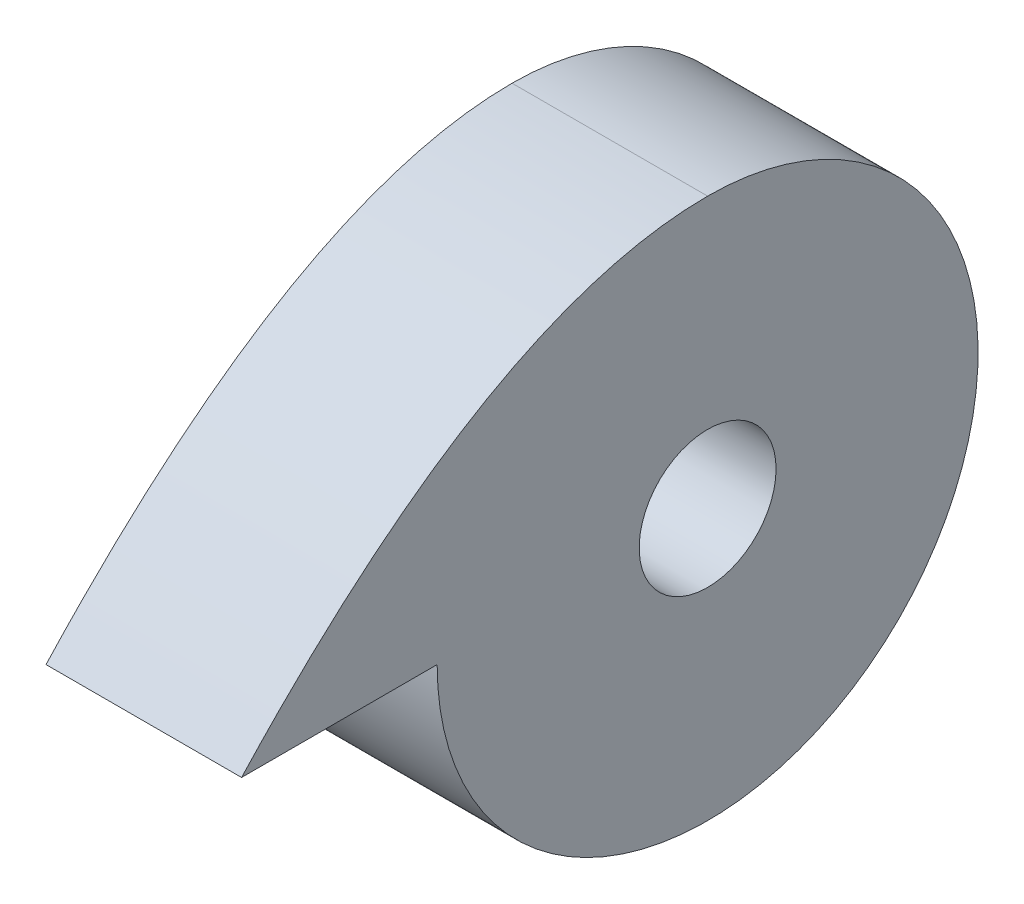
ISO-10303-21;
HEADER;
FILE_DESCRIPTION(('STEP AP214'),'2;1');
FILE_NAME('part.step','',(''),(''),'','','');
FILE_SCHEMA(('AUTOMOTIVE_DESIGN { 1 0 10303 214 1 1 1 1 }'));
ENDSEC;
DATA;
#1=APPLICATION_CONTEXT('core data for automotive mechanical design processes');
#2=APPLICATION_PROTOCOL_DEFINITION('international standard','automotive_design',2000,#1);
#3=PRODUCT_CONTEXT('',#1,'mechanical');
#4=PRODUCT('Part','Part','',(#3));
#5=PRODUCT_RELATED_PRODUCT_CATEGORY('part','',(#4));
#6=PRODUCT_DEFINITION_FORMATION('','',#4);
#7=PRODUCT_DEFINITION_CONTEXT('part definition',#1,'design');
#8=PRODUCT_DEFINITION('design','',#6,#7);
#9=PRODUCT_DEFINITION_SHAPE('','',#8);
#10=(LENGTH_UNIT() NAMED_UNIT(*) SI_UNIT(.MILLI.,.METRE.));
#11=(NAMED_UNIT(*) PLANE_ANGLE_UNIT() SI_UNIT($,.RADIAN.));
#12=(NAMED_UNIT(*) SI_UNIT($,.STERADIAN.) SOLID_ANGLE_UNIT());
#13=UNCERTAINTY_MEASURE_WITH_UNIT(LENGTH_MEASURE(1.E-05),#10,'distance_accuracy_value','');
#14=(GEOMETRIC_REPRESENTATION_CONTEXT(3) GLOBAL_UNCERTAINTY_ASSIGNED_CONTEXT((#13)) GLOBAL_UNIT_ASSIGNED_CONTEXT((#10,
#11,#12)) REPRESENTATION_CONTEXT('',''));
#15=CARTESIAN_POINT('',(0.,0.,0.));
#16=DIRECTION('',(0.,0.,1.));
#17=DIRECTION('',(1.,0.,0.));
#18=AXIS2_PLACEMENT_3D('',#15,#16,#17);
#19=CARTESIAN_POINT('',(10.,7.44667103445581,34.1057533378076));
#20=DIRECTION('',(-1.,0.,0.));
#21=DIRECTION('',(0.,0.,1.));
#22=AXIS2_PLACEMENT_3D('',#19,#20,#21);
#23=CYLINDRICAL_SURFACE('',#22,13.8293473102586);
#24=CARTESIAN_POINT('',(0.,7.44667103445581,34.1057533378076));
#25=DIRECTION('',(1.,0.,0.));
#26=DIRECTION('',(0.,0.,-1.));
#27=AXIS2_PLACEMENT_3D('',#24,#25,#26);
#28=CIRCLE('',#27,13.8293473102586);
#29=CARTESIAN_POINT('',(0.,7.44667103445581,47.9351006480662));
#30=VERTEX_POINT('',#29);
#31=CARTESIAN_POINT('',(0.,21.2760183447144,34.1057533378076));
#32=VERTEX_POINT('',#31);
#33=EDGE_CURVE('E80',#30,#32,#28,.T.);
#34=ORIENTED_EDGE('',*,*,#33,.T.);
#35=DIRECTION('',(-1.,0.,0.));
#36=VECTOR('',#35,1.);
#37=CARTESIAN_POINT('',(10.,21.2760183447144,34.1057533378076));
#38=LINE('',#37,#36);
#39=CARTESIAN_POINT('',(10.,21.2760183447144,34.1057533378076));
#40=VERTEX_POINT('',#39);
#41=EDGE_CURVE('E11',#40,#32,#38,.T.);
#42=ORIENTED_EDGE('',*,*,#41,.F.);
#43=CARTESIAN_POINT('',(10.,7.44667103445581,34.1057533378076));
#44=DIRECTION('',(1.,0.,0.));
#45=DIRECTION('',(0.,0.,-1.));
#46=AXIS2_PLACEMENT_3D('',#43,#44,#45);
#47=CIRCLE('',#46,13.8293473102586);
#48=CARTESIAN_POINT('',(10.,7.44667103445581,47.9351006480662));
#49=VERTEX_POINT('',#48);
#50=EDGE_CURVE('E73',#49,#40,#47,.T.);
#51=ORIENTED_EDGE('',*,*,#50,.F.);
#52=DIRECTION('',(-1.,0.,0.));
#53=VECTOR('',#52,1.);
#54=CARTESIAN_POINT('',(10.,7.44667103445581,47.9351006480662));
#55=LINE('',#54,#53);
#56=EDGE_CURVE('E81',#49,#30,#55,.T.);
#57=ORIENTED_EDGE('',*,*,#56,.T.);
#58=EDGE_LOOP('',(#34,#42,#51,#57));
#59=FACE_BOUND('',#58,.T.);
#60=ADVANCED_FACE('F33',(#59),#23,.T.);
#61=CARTESIAN_POINT('',(10.,21.2760183447144,34.1057533378076));
#62=CARTESIAN_POINT('',(10.,21.2760183447144,45.1574762104901));
#63=CARTESIAN_POINT('',(10.,7.4466710344558,57.9351006480662));
#64=B_SPLINE_CURVE_WITH_KNOTS('',2,(#61,#62,#63),.UNSPECIFIED.,.F.,.F.,(3,3),(0.,1.),.UNSPECIFIED.);
#65=DIRECTION('',(-1.,0.,0.));
#66=VECTOR('',#65,1.);
#67=SURFACE_OF_LINEAR_EXTRUSION('',#64,#66);
#68=CARTESIAN_POINT('',(0.,21.2760183447144,34.1057533378076));
#69=CARTESIAN_POINT('',(0.,21.2760183447144,45.1574762104901));
#70=CARTESIAN_POINT('',(0.,7.4466710344558,57.9351006480662));
#71=B_SPLINE_CURVE_WITH_KNOTS('',2,(#68,#69,#70),.UNSPECIFIED.,.F.,.F.,(3,3),(0.,1.),.UNSPECIFIED.);
#72=CARTESIAN_POINT('',(0.,7.44667103445581,57.9351006480662));
#73=VERTEX_POINT('',#72);
#74=EDGE_CURVE('E61',#32,#73,#71,.T.);
#75=ORIENTED_EDGE('',*,*,#74,.T.);
#76=DIRECTION('',(-1.,0.,0.));
#77=VECTOR('',#76,1.);
#78=CARTESIAN_POINT('',(10.,7.44667103445581,57.9351006480662));
#79=LINE('',#78,#77);
#80=CARTESIAN_POINT('',(10.,7.44667103445581,57.9351006480662));
#81=VERTEX_POINT('',#80);
#82=EDGE_CURVE('E41',#81,#73,#79,.T.);
#83=ORIENTED_EDGE('',*,*,#82,.F.);
#84=EDGE_CURVE('E69',#40,#81,#64,.T.);
#85=ORIENTED_EDGE('',*,*,#84,.F.);
#86=ORIENTED_EDGE('',*,*,#41,.T.);
#87=EDGE_LOOP('',(#75,#83,#85,#86));
#88=FACE_BOUND('',#87,.T.);
#89=ADVANCED_FACE('F70',(#88),#67,.F.);
#90=CARTESIAN_POINT('',(10.,7.44667103445581,47.9351006480662));
#91=DIRECTION('',(0.,1.,0.));
#92=DIRECTION('',(0.,0.,1.));
#93=AXIS2_PLACEMENT_3D('',#90,#91,#92);
#94=PLANE('',#93);
#95=DIRECTION('',(0.,0.,-1.));
#96=VECTOR('',#95,1.);
#97=CARTESIAN_POINT('',(0.,7.44667103445581,47.9351006480662));
#98=LINE('',#97,#96);
#99=EDGE_CURVE('E66',#73,#30,#98,.T.);
#100=ORIENTED_EDGE('',*,*,#99,.T.);
#101=ORIENTED_EDGE('',*,*,#56,.F.);
#102=DIRECTION('',(0.,0.,-1.));
#103=VECTOR('',#102,1.);
#104=CARTESIAN_POINT('',(10.,7.44667103445581,47.9351006480662));
#105=LINE('',#104,#103);
#106=EDGE_CURVE('E49',#81,#49,#105,.T.);
#107=ORIENTED_EDGE('',*,*,#106,.F.);
#108=ORIENTED_EDGE('',*,*,#82,.T.);
#109=EDGE_LOOP('',(#100,#101,#107,#108));
#110=FACE_BOUND('',#109,.T.);
#111=ADVANCED_FACE('F97',(#110),#94,.F.);
#112=CARTESIAN_POINT('',(10.,7.44667103445581,34.1057533378076));
#113=DIRECTION('',(1.,0.,0.));
#114=DIRECTION('',(0.,0.,-1.));
#115=AXIS2_PLACEMENT_3D('',#112,#113,#114);
#116=PLANE('',#115);
#117=CARTESIAN_POINT('',(10.,7.44667103445581,34.1057533378076));
#118=DIRECTION('',(1.,0.,0.));
#119=DIRECTION('',(0.,0.,-1.));
#120=AXIS2_PLACEMENT_3D('',#117,#118,#119);
#121=CIRCLE('',#120,3.49999999999999);
#122=CARTESIAN_POINT('',(10.,7.44667103445581,30.6057533378076));
#123=VERTEX_POINT('',#122);
#124=EDGE_CURVE('E87',#123,#123,#121,.T.);
#125=ORIENTED_EDGE('',*,*,#124,.F.);
#126=EDGE_LOOP('',(#125));
#127=FACE_BOUND('',#126,.T.);
#128=ORIENTED_EDGE('',*,*,#50,.T.);
#129=ORIENTED_EDGE('',*,*,#84,.T.);
#130=ORIENTED_EDGE('',*,*,#106,.T.);
#131=EDGE_LOOP('',(#128,#129,#130));
#132=FACE_BOUND('',#131,.T.);
#133=ADVANCED_FACE('F76',(#127,#132),#116,.T.);
#134=CARTESIAN_POINT('',(0.,7.44667103445581,34.1057533378076));
#135=DIRECTION('',(1.,0.,0.));
#136=DIRECTION('',(0.,0.,-1.));
#137=AXIS2_PLACEMENT_3D('',#134,#135,#136);
#138=PLANE('',#137);
#139=CARTESIAN_POINT('',(0.,7.44667103445581,34.1057533378076));
#140=DIRECTION('',(1.,0.,0.));
#141=DIRECTION('',(0.,0.,-1.));
#142=AXIS2_PLACEMENT_3D('',#139,#140,#141);
#143=CIRCLE('',#142,3.49999999999999);
#144=CARTESIAN_POINT('',(0.,7.44667103445581,30.6057533378076));
#145=VERTEX_POINT('',#144);
#146=EDGE_CURVE('E83',#145,#145,#143,.T.);
#147=ORIENTED_EDGE('',*,*,#146,.T.);
#148=EDGE_LOOP('',(#147));
#149=FACE_BOUND('',#148,.T.);
#150=ORIENTED_EDGE('',*,*,#33,.F.);
#151=ORIENTED_EDGE('',*,*,#99,.F.);
#152=ORIENTED_EDGE('',*,*,#74,.F.);
#153=EDGE_LOOP('',(#150,#151,#152));
#154=FACE_BOUND('',#153,.T.);
#155=ADVANCED_FACE('F98',(#149,#154),#138,.F.);
#156=CARTESIAN_POINT('',(10.,7.44667103445581,34.1057533378076));
#157=DIRECTION('',(1.,0.,0.));
#158=DIRECTION('',(0.,0.,-1.));
#159=AXIS2_PLACEMENT_3D('',#156,#157,#158);
#160=CYLINDRICAL_SURFACE('',#159,3.49999999999999);
#161=ORIENTED_EDGE('',*,*,#146,.F.);
#162=EDGE_LOOP('',(#161));
#163=FACE_BOUND('',#162,.T.);
#164=ORIENTED_EDGE('',*,*,#124,.T.);
#165=EDGE_LOOP('',(#164));
#166=FACE_BOUND('',#165,.T.);
#167=ADVANCED_FACE('F100',(#163,#166),#160,.F.);
#168=CLOSED_SHELL('',(#60,#89,#111,#133,#155,#167));
#169=MANIFOLD_SOLID_BREP('B2',#168);
#170=ADVANCED_BREP_SHAPE_REPRESENTATION('',(#18,#169),#14);
#171=SHAPE_DEFINITION_REPRESENTATION(#9,#170);
ENDSEC;
END-ISO-10303-21;
